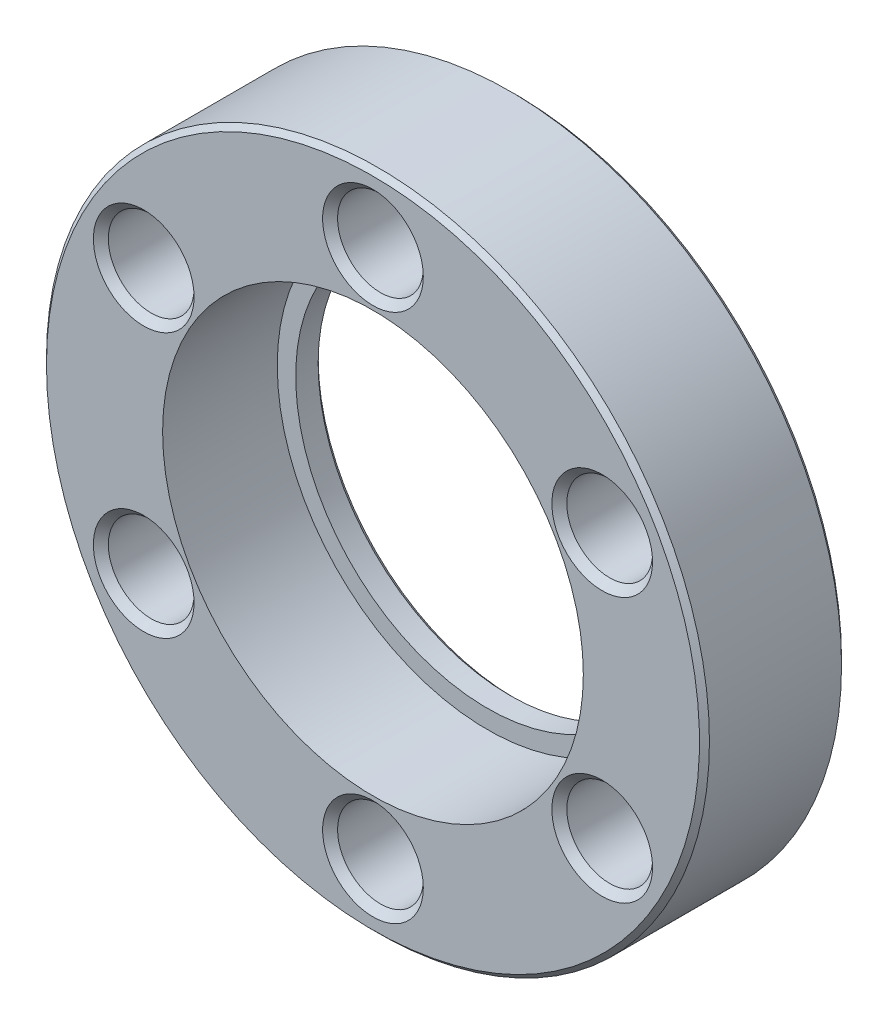
ISO-10303-21;
HEADER;
FILE_DESCRIPTION(('STEP AP214'),'2;1');
FILE_NAME('part.step','',(''),(''),'','','');
FILE_SCHEMA(('AUTOMOTIVE_DESIGN { 1 0 10303 214 1 1 1 1 }'));
ENDSEC;
DATA;
#1=APPLICATION_CONTEXT('core data for automotive mechanical design processes');
#2=APPLICATION_PROTOCOL_DEFINITION('international standard','automotive_design',2000,#1);
#3=PRODUCT_CONTEXT('',#1,'mechanical');
#4=PRODUCT('Part','Part','',(#3));
#5=PRODUCT_RELATED_PRODUCT_CATEGORY('part','',(#4));
#6=PRODUCT_DEFINITION_FORMATION('','',#4);
#7=PRODUCT_DEFINITION_CONTEXT('part definition',#1,'design');
#8=PRODUCT_DEFINITION('design','',#6,#7);
#9=PRODUCT_DEFINITION_SHAPE('','',#8);
#10=(LENGTH_UNIT() NAMED_UNIT(*) SI_UNIT(.MILLI.,.METRE.));
#11=(NAMED_UNIT(*) PLANE_ANGLE_UNIT() SI_UNIT($,.RADIAN.));
#12=(NAMED_UNIT(*) SI_UNIT($,.STERADIAN.) SOLID_ANGLE_UNIT());
#13=UNCERTAINTY_MEASURE_WITH_UNIT(LENGTH_MEASURE(1.E-05),#10,'distance_accuracy_value','');
#14=(GEOMETRIC_REPRESENTATION_CONTEXT(3) GLOBAL_UNCERTAINTY_ASSIGNED_CONTEXT((#13)) GLOBAL_UNIT_ASSIGNED_CONTEXT((#10,
#11,#12)) REPRESENTATION_CONTEXT('',''));
#15=CARTESIAN_POINT('',(0.,0.,0.));
#16=DIRECTION('',(0.,0.,1.));
#17=DIRECTION('',(1.,0.,0.));
#18=AXIS2_PLACEMENT_3D('',#15,#16,#17);
#19=CARTESIAN_POINT('',(0.,0.,-7.60095));
#20=DIRECTION('',(0.,0.,1.));
#21=DIRECTION('',(1.,0.,0.));
#22=AXIS2_PLACEMENT_3D('',#19,#20,#21);
#23=CYLINDRICAL_SURFACE('',#22,10.7188);
#24=CARTESIAN_POINT('',(0.,0.,-5.842));
#25=DIRECTION('',(0.,0.,1.));
#26=DIRECTION('',(1.,0.,0.));
#27=AXIS2_PLACEMENT_3D('',#24,#25,#26);
#28=CIRCLE('',#27,10.7188);
#29=CARTESIAN_POINT('',(10.7188,0.,-5.842));
#30=VERTEX_POINT('',#29);
#31=EDGE_CURVE('E72',#30,#30,#28,.T.);
#32=ORIENTED_EDGE('',*,*,#31,.F.);
#33=EDGE_LOOP('',(#32));
#34=FACE_BOUND('',#33,.T.);
#35=CARTESIAN_POINT('',(0.,0.,0.));
#36=DIRECTION('',(0.,0.,1.));
#37=DIRECTION('',(1.,0.,0.));
#38=AXIS2_PLACEMENT_3D('',#35,#36,#37);
#39=CIRCLE('',#38,10.7188);
#40=CARTESIAN_POINT('',(10.7188,0.,0.));
#41=VERTEX_POINT('',#40);
#42=EDGE_CURVE('E17',#41,#41,#39,.F.);
#43=ORIENTED_EDGE('',*,*,#42,.F.);
#44=EDGE_LOOP('',(#43));
#45=FACE_BOUND('',#44,.T.);
#46=ADVANCED_FACE('F14',(#34,#45),#23,.F.);
#47=CARTESIAN_POINT('',(0.,0.,0.));
#48=DIRECTION('',(0.,0.,1.));
#49=DIRECTION('',(1.,0.,0.));
#50=AXIS2_PLACEMENT_3D('',#47,#48,#49);
#51=PLANE('',#50);
#52=CARTESIAN_POINT('',(-11.6804310310013,6.7437,-5.6843418860808E-11));
#53=DIRECTION('',(0.,0.,1.));
#54=DIRECTION('',(1.,0.,0.));
#55=AXIS2_PLACEMENT_3D('',#52,#53,#54);
#56=CIRCLE('',#55,2.56539999999999);
#57=CARTESIAN_POINT('',(-9.11503103100131,6.7437,-5.6843418860808E-11));
#58=VERTEX_POINT('',#57);
#59=EDGE_CURVE('E54',#58,#58,#56,.F.);
#60=ORIENTED_EDGE('',*,*,#59,.T.);
#61=EDGE_LOOP('',(#60));
#62=FACE_BOUND('',#61,.T.);
#63=CARTESIAN_POINT('',(-11.6804310310013,-6.7437,-5.6843418860808E-11));
#64=DIRECTION('',(0.,0.,1.));
#65=DIRECTION('',(1.,0.,0.));
#66=AXIS2_PLACEMENT_3D('',#63,#64,#65);
#67=CIRCLE('',#66,2.56539999999999);
#68=CARTESIAN_POINT('',(-9.11503103100131,-6.7437,-5.6843418860808E-11));
#69=VERTEX_POINT('',#68);
#70=EDGE_CURVE('E57',#69,#69,#67,.F.);
#71=ORIENTED_EDGE('',*,*,#70,.T.);
#72=EDGE_LOOP('',(#71));
#73=FACE_BOUND('',#72,.T.);
#74=CARTESIAN_POINT('',(0.,-13.4874,0.));
#75=DIRECTION('',(0.,0.,1.));
#76=DIRECTION('',(1.,0.,0.));
#77=AXIS2_PLACEMENT_3D('',#74,#75,#76);
#78=CIRCLE('',#77,2.5653999999804);
#79=CARTESIAN_POINT('',(2.5653999999804,-13.4874,0.));
#80=VERTEX_POINT('',#79);
#81=EDGE_CURVE('E60',#80,#80,#78,.F.);
#82=ORIENTED_EDGE('',*,*,#81,.T.);
#83=EDGE_LOOP('',(#82));
#84=FACE_BOUND('',#83,.T.);
#85=CARTESIAN_POINT('',(11.6804310310013,-6.7437,0.));
#86=DIRECTION('',(0.,0.,1.));
#87=DIRECTION('',(1.,0.,0.));
#88=AXIS2_PLACEMENT_3D('',#85,#86,#87);
#89=CIRCLE('',#88,2.56540000001765);
#90=CARTESIAN_POINT('',(14.245831031019,-6.7437,0.));
#91=VERTEX_POINT('',#90);
#92=EDGE_CURVE('E63',#91,#91,#89,.F.);
#93=ORIENTED_EDGE('',*,*,#92,.T.);
#94=EDGE_LOOP('',(#93));
#95=FACE_BOUND('',#94,.T.);
#96=CARTESIAN_POINT('',(11.6804310310013,6.7437,0.));
#97=DIRECTION('',(0.,0.,1.));
#98=DIRECTION('',(1.,0.,0.));
#99=AXIS2_PLACEMENT_3D('',#96,#97,#98);
#100=CIRCLE('',#99,2.56540000001765);
#101=CARTESIAN_POINT('',(14.245831031019,6.7437,0.));
#102=VERTEX_POINT('',#101);
#103=EDGE_CURVE('E66',#102,#102,#100,.F.);
#104=ORIENTED_EDGE('',*,*,#103,.T.);
#105=EDGE_LOOP('',(#104));
#106=FACE_BOUND('',#105,.T.);
#107=CARTESIAN_POINT('',(0.,13.4874,0.));
#108=DIRECTION('',(0.,0.,1.));
#109=DIRECTION('',(1.,0.,0.));
#110=AXIS2_PLACEMENT_3D('',#107,#108,#109);
#111=CIRCLE('',#110,2.5653999999804);
#112=CARTESIAN_POINT('',(2.5653999999804,13.4874,0.));
#113=VERTEX_POINT('',#112);
#114=EDGE_CURVE('E69',#113,#113,#111,.F.);
#115=ORIENTED_EDGE('',*,*,#114,.T.);
#116=EDGE_LOOP('',(#115));
#117=FACE_BOUND('',#116,.T.);
#118=ORIENTED_EDGE('',*,*,#42,.T.);
#119=EDGE_LOOP('',(#118));
#120=FACE_BOUND('',#119,.T.);
#121=CARTESIAN_POINT('',(0.,0.,0.));
#122=DIRECTION('',(0.,0.,-1.));
#123=DIRECTION('',(-1.,0.,0.));
#124=AXIS2_PLACEMENT_3D('',#121,#122,#123);
#125=CIRCLE('',#124,16.637);
#126=CARTESIAN_POINT('',(-16.637,0.,0.));
#127=VERTEX_POINT('',#126);
#128=EDGE_CURVE('E74',#127,#127,#125,.T.);
#129=ORIENTED_EDGE('',*,*,#128,.F.);
#130=EDGE_LOOP('',(#129));
#131=FACE_BOUND('',#130,.T.);
#132=ADVANCED_FACE('F81',(#62,#73,#84,#95,#106,#117,#120,#131),#51,.T.);
#133=CARTESIAN_POINT('',(0.,0.,-0.254000000000019));
#134=DIRECTION('',(0.,0.,-1.));
#135=DIRECTION('',(-1.,0.,0.));
#136=AXIS2_PLACEMENT_3D('',#133,#134,#135);
#137=CONICAL_SURFACE('',#136,16.891,0.785398163397301);
#138=CARTESIAN_POINT('',(0.,0.,-0.254));
#139=DIRECTION('',(0.,0.,1.));
#140=DIRECTION('',(1.,0.,0.));
#141=AXIS2_PLACEMENT_3D('',#138,#139,#140);
#142=CIRCLE('',#141,16.891);
#143=CARTESIAN_POINT('',(16.891,0.,-0.254));
#144=VERTEX_POINT('',#143);
#145=EDGE_CURVE('E29',#144,#144,#142,.F.);
#146=ORIENTED_EDGE('',*,*,#145,.F.);
#147=EDGE_LOOP('',(#146));
#148=FACE_BOUND('',#147,.T.);
#149=ORIENTED_EDGE('',*,*,#128,.T.);
#150=EDGE_LOOP('',(#149));
#151=FACE_BOUND('',#150,.T.);
#152=ADVANCED_FACE('F90',(#148,#151),#137,.T.);
#153=CARTESIAN_POINT('',(0.,0.,-5.842));
#154=DIRECTION('',(0.,0.,1.));
#155=DIRECTION('',(1.,0.,0.));
#156=AXIS2_PLACEMENT_3D('',#153,#154,#155);
#157=PLANE('',#156);
#158=CARTESIAN_POINT('',(0.,0.,-5.842));
#159=DIRECTION('',(0.,0.,1.));
#160=DIRECTION('',(1.,0.,0.));
#161=AXIS2_PLACEMENT_3D('',#158,#159,#160);
#162=CIRCLE('',#161,9.779);
#163=CARTESIAN_POINT('',(9.779,0.,-5.842));
#164=VERTEX_POINT('',#163);
#165=EDGE_CURVE('E50',#164,#164,#162,.F.);
#166=ORIENTED_EDGE('',*,*,#165,.T.);
#167=EDGE_LOOP('',(#166));
#168=FACE_BOUND('',#167,.T.);
#169=ORIENTED_EDGE('',*,*,#31,.T.);
#170=EDGE_LOOP('',(#169));
#171=FACE_BOUND('',#170,.T.);
#172=ADVANCED_FACE('F188',(#168,#171),#157,.T.);
#173=CARTESIAN_POINT('',(0.,13.4874,-5.6843418860808E-11));
#174=DIRECTION('',(0.,0.,1.));
#175=DIRECTION('',(1.,0.,0.));
#176=AXIS2_PLACEMENT_3D('',#173,#174,#175);
#177=CONICAL_SURFACE('',#176,2.56539999992356,0.785398163397448);
#178=CARTESIAN_POINT('',(0.,13.4874,-0.381));
#179=DIRECTION('',(0.,0.,-1.));
#180=DIRECTION('',(-1.,0.,0.));
#181=AXIS2_PLACEMENT_3D('',#178,#179,#180);
#182=CIRCLE('',#181,2.1844);
#183=CARTESIAN_POINT('',(-2.1844,13.4874,-0.381));
#184=VERTEX_POINT('',#183);
#185=EDGE_CURVE('E53',#184,#184,#182,.T.);
#186=ORIENTED_EDGE('',*,*,#185,.T.);
#187=EDGE_LOOP('',(#186));
#188=FACE_BOUND('',#187,.T.);
#189=ORIENTED_EDGE('',*,*,#114,.F.);
#190=EDGE_LOOP('',(#189));
#191=FACE_BOUND('',#190,.T.);
#192=ADVANCED_FACE('F184',(#188,#191),#177,.F.);
#193=CARTESIAN_POINT('',(11.6804310310013,6.7437,5.6843418860808E-11));
#194=DIRECTION('',(0.,0.,1.));
#195=DIRECTION('',(1.,0.,0.));
#196=AXIS2_PLACEMENT_3D('',#193,#194,#195);
#197=CONICAL_SURFACE('',#196,2.56540000007449,0.785398163397448);
#198=CARTESIAN_POINT('',(11.6804310310013,6.7437,-0.381));
#199=DIRECTION('',(0.,0.,-1.));
#200=DIRECTION('',(-1.,0.,0.));
#201=AXIS2_PLACEMENT_3D('',#198,#199,#200);
#202=CIRCLE('',#201,2.1844);
#203=CARTESIAN_POINT('',(9.4960310310013,6.7437,-0.381));
#204=VERTEX_POINT('',#203);
#205=EDGE_CURVE('E335',#204,#204,#202,.T.);
#206=ORIENTED_EDGE('',*,*,#205,.T.);
#207=EDGE_LOOP('',(#206));
#208=FACE_BOUND('',#207,.T.);
#209=ORIENTED_EDGE('',*,*,#103,.F.);
#210=EDGE_LOOP('',(#209));
#211=FACE_BOUND('',#210,.T.);
#212=ADVANCED_FACE('F180',(#208,#211),#197,.F.);
#213=CARTESIAN_POINT('',(11.6804310310013,-6.7437,5.6843418860808E-11));
#214=DIRECTION('',(0.,0.,1.));
#215=DIRECTION('',(1.,0.,0.));
#216=AXIS2_PLACEMENT_3D('',#213,#214,#215);
#217=CONICAL_SURFACE('',#216,2.56540000007449,0.785398163397448);
#218=CARTESIAN_POINT('',(11.6804310310013,-6.7437,-0.381));
#219=DIRECTION('',(0.,0.,-1.));
#220=DIRECTION('',(-1.,0.,0.));
#221=AXIS2_PLACEMENT_3D('',#218,#219,#220);
#222=CIRCLE('',#221,2.1844);
#223=CARTESIAN_POINT('',(9.4960310310013,-6.7437,-0.381));
#224=VERTEX_POINT('',#223);
#225=EDGE_CURVE('E332',#224,#224,#222,.T.);
#226=ORIENTED_EDGE('',*,*,#225,.T.);
#227=EDGE_LOOP('',(#226));
#228=FACE_BOUND('',#227,.T.);
#229=ORIENTED_EDGE('',*,*,#92,.F.);
#230=EDGE_LOOP('',(#229));
#231=FACE_BOUND('',#230,.T.);
#232=ADVANCED_FACE('F176',(#228,#231),#217,.F.);
#233=CARTESIAN_POINT('',(0.,-13.4874,-5.6843418860808E-11));
#234=DIRECTION('',(0.,0.,1.));
#235=DIRECTION('',(1.,0.,0.));
#236=AXIS2_PLACEMENT_3D('',#233,#234,#235);
#237=CONICAL_SURFACE('',#236,2.56539999992356,0.785398163397448);
#238=CARTESIAN_POINT('',(0.,-13.4874,-0.381));
#239=DIRECTION('',(0.,0.,-1.));
#240=DIRECTION('',(-1.,0.,0.));
#241=AXIS2_PLACEMENT_3D('',#238,#239,#240);
#242=CIRCLE('',#241,2.1844);
#243=CARTESIAN_POINT('',(-2.1844,-13.4874,-0.381));
#244=VERTEX_POINT('',#243);
#245=EDGE_CURVE('E329',#244,#244,#242,.T.);
#246=ORIENTED_EDGE('',*,*,#245,.T.);
#247=EDGE_LOOP('',(#246));
#248=FACE_BOUND('',#247,.T.);
#249=ORIENTED_EDGE('',*,*,#81,.F.);
#250=EDGE_LOOP('',(#249));
#251=FACE_BOUND('',#250,.T.);
#252=ADVANCED_FACE('F172',(#248,#251),#237,.F.);
#253=CARTESIAN_POINT('',(-11.6804310310013,-6.7437,-5.6843418860808E-11));
#254=DIRECTION('',(0.,0.,1.));
#255=DIRECTION('',(1.,0.,0.));
#256=AXIS2_PLACEMENT_3D('',#253,#254,#255);
#257=CONICAL_SURFACE('',#256,2.56539999999999,0.785398163397448);
#258=CARTESIAN_POINT('',(-11.6804310310013,-6.7437,-0.381));
#259=DIRECTION('',(0.,0.,-1.));
#260=DIRECTION('',(-1.,0.,0.));
#261=AXIS2_PLACEMENT_3D('',#258,#259,#260);
#262=CIRCLE('',#261,2.1844);
#263=CARTESIAN_POINT('',(-13.8648310310013,-6.7437,-0.381));
#264=VERTEX_POINT('',#263);
#265=EDGE_CURVE('E326',#264,#264,#262,.T.);
#266=ORIENTED_EDGE('',*,*,#265,.T.);
#267=EDGE_LOOP('',(#266));
#268=FACE_BOUND('',#267,.T.);
#269=ORIENTED_EDGE('',*,*,#70,.F.);
#270=EDGE_LOOP('',(#269));
#271=FACE_BOUND('',#270,.T.);
#272=ADVANCED_FACE('F168',(#268,#271),#257,.F.);
#273=CARTESIAN_POINT('',(-11.6804310310013,6.7437,-5.6843418860808E-11));
#274=DIRECTION('',(0.,0.,1.));
#275=DIRECTION('',(1.,0.,0.));
#276=AXIS2_PLACEMENT_3D('',#273,#274,#275);
#277=CONICAL_SURFACE('',#276,2.56539999999999,0.785398163397448);
#278=CARTESIAN_POINT('',(-11.6804310310013,6.7437,-0.381));
#279=DIRECTION('',(0.,0.,-1.));
#280=DIRECTION('',(-1.,0.,0.));
#281=AXIS2_PLACEMENT_3D('',#278,#279,#280);
#282=CIRCLE('',#281,2.1844);
#283=CARTESIAN_POINT('',(-13.8648310310013,6.7437,-0.381));
#284=VERTEX_POINT('',#283);
#285=EDGE_CURVE('E320',#284,#284,#282,.T.);
#286=ORIENTED_EDGE('',*,*,#285,.T.);
#287=EDGE_LOOP('',(#286));
#288=FACE_BOUND('',#287,.T.);
#289=ORIENTED_EDGE('',*,*,#59,.F.);
#290=EDGE_LOOP('',(#289));
#291=FACE_BOUND('',#290,.T.);
#292=ADVANCED_FACE('F164',(#288,#291),#277,.F.);
#293=CARTESIAN_POINT('',(0.,0.,0.));
#294=DIRECTION('',(0.,0.,1.));
#295=DIRECTION('',(1.,0.,0.));
#296=AXIS2_PLACEMENT_3D('',#293,#294,#295);
#297=CYLINDRICAL_SURFACE('',#296,16.891);
#298=CARTESIAN_POINT('',(0.,0.,-6.98499999999998));
#299=DIRECTION('',(0.,0.,1.));
#300=DIRECTION('',(1.,0.,0.));
#301=AXIS2_PLACEMENT_3D('',#298,#299,#300);
#302=CIRCLE('',#301,16.891);
#303=CARTESIAN_POINT('',(16.891,0.,-6.98499999999998));
#304=VERTEX_POINT('',#303);
#305=EDGE_CURVE('E314',#304,#304,#302,.F.);
#306=ORIENTED_EDGE('',*,*,#305,.F.);
#307=EDGE_LOOP('',(#306));
#308=FACE_BOUND('',#307,.T.);
#309=ORIENTED_EDGE('',*,*,#145,.T.);
#310=EDGE_LOOP('',(#309));
#311=FACE_BOUND('',#310,.T.);
#312=ADVANCED_FACE('F160',(#308,#311),#297,.T.);
#313=CARTESIAN_POINT('',(0.,0.,-7.60095));
#314=DIRECTION('',(0.,0.,1.));
#315=DIRECTION('',(1.,0.,0.));
#316=AXIS2_PLACEMENT_3D('',#313,#314,#315);
#317=CYLINDRICAL_SURFACE('',#316,9.779);
#318=ORIENTED_EDGE('',*,*,#165,.F.);
#319=EDGE_LOOP('',(#318));
#320=FACE_BOUND('',#319,.T.);
#321=CARTESIAN_POINT('',(0.,0.,-6.98499999999998));
#322=DIRECTION('',(0.,0.,-1.));
#323=DIRECTION('',(0.,-1.,0.));
#324=AXIS2_PLACEMENT_3D('',#321,#322,#323);
#325=CIRCLE('',#324,9.77900000000002);
#326=CARTESIAN_POINT('',(0.,-9.77900000000002,-6.98499999999998));
#327=VERTEX_POINT('',#326);
#328=EDGE_CURVE('E312',#327,#327,#325,.T.);
#329=ORIENTED_EDGE('',*,*,#328,.T.);
#330=EDGE_LOOP('',(#329));
#331=FACE_BOUND('',#330,.T.);
#332=ADVANCED_FACE('F156',(#320,#331),#317,.F.);
#333=CARTESIAN_POINT('',(0.,13.4874,0.));
#334=DIRECTION('',(0.,0.,-1.));
#335=DIRECTION('',(-1.,0.,0.));
#336=AXIS2_PLACEMENT_3D('',#333,#334,#335);
#337=CYLINDRICAL_SURFACE('',#336,2.1844);
#338=CARTESIAN_POINT('',(0.,13.4874,-6.85799999996561));
#339=DIRECTION('',(0.,0.,-1.));
#340=DIRECTION('',(-1.,0.,0.));
#341=AXIS2_PLACEMENT_3D('',#338,#339,#340);
#342=CIRCLE('',#341,2.18439999997599);
#343=CARTESIAN_POINT('',(-2.18439999997599,13.4874,-6.85799999996561));
#344=VERTEX_POINT('',#343);
#345=EDGE_CURVE('E313',#344,#344,#342,.T.);
#346=ORIENTED_EDGE('',*,*,#345,.T.);
#347=EDGE_LOOP('',(#346));
#348=FACE_BOUND('',#347,.T.);
#349=ORIENTED_EDGE('',*,*,#185,.F.);
#350=EDGE_LOOP('',(#349));
#351=FACE_BOUND('',#350,.T.);
#352=ADVANCED_FACE('F152',(#348,#351),#337,.F.);
#353=CARTESIAN_POINT('',(11.6804310310013,6.7437,0.));
#354=DIRECTION('',(0.,0.,-1.));
#355=DIRECTION('',(-1.,0.,0.));
#356=AXIS2_PLACEMENT_3D('',#353,#354,#355);
#357=CYLINDRICAL_SURFACE('',#356,2.1844);
#358=CARTESIAN_POINT('',(11.6804310310013,6.7437,-6.85800000002246));
#359=DIRECTION('',(0.,0.,-1.));
#360=DIRECTION('',(-1.,0.,0.));
#361=AXIS2_PLACEMENT_3D('',#358,#359,#360);
#362=CIRCLE('',#361,2.18439999999559);
#363=CARTESIAN_POINT('',(9.49603103100571,6.7437,-6.85800000002246));
#364=VERTEX_POINT('',#363);
#365=EDGE_CURVE('E317',#364,#364,#362,.T.);
#366=ORIENTED_EDGE('',*,*,#365,.T.);
#367=EDGE_LOOP('',(#366));
#368=FACE_BOUND('',#367,.T.);
#369=ORIENTED_EDGE('',*,*,#205,.F.);
#370=EDGE_LOOP('',(#369));
#371=FACE_BOUND('',#370,.T.);
#372=ADVANCED_FACE('F148',(#368,#371),#357,.F.);
#373=CARTESIAN_POINT('',(11.6804310310013,-6.7437,0.));
#374=DIRECTION('',(0.,0.,-1.));
#375=DIRECTION('',(-1.,0.,0.));
#376=AXIS2_PLACEMENT_3D('',#373,#374,#375);
#377=CYLINDRICAL_SURFACE('',#376,2.1844);
#378=CARTESIAN_POINT('',(11.6804310310013,-6.7437,-6.85800000002246));
#379=DIRECTION('',(0.,0.,-1.));
#380=DIRECTION('',(-1.,0.,0.));
#381=AXIS2_PLACEMENT_3D('',#378,#379,#380);
#382=CIRCLE('',#381,2.18439999999559);
#383=CARTESIAN_POINT('',(9.49603103100571,-6.7437,-6.85800000002246));
#384=VERTEX_POINT('',#383);
#385=EDGE_CURVE('E369',#384,#384,#382,.T.);
#386=ORIENTED_EDGE('',*,*,#385,.T.);
#387=EDGE_LOOP('',(#386));
#388=FACE_BOUND('',#387,.T.);
#389=ORIENTED_EDGE('',*,*,#225,.F.);
#390=EDGE_LOOP('',(#389));
#391=FACE_BOUND('',#390,.T.);
#392=ADVANCED_FACE('F144',(#388,#391),#377,.F.);
#393=CARTESIAN_POINT('',(0.,-13.4874,0.));
#394=DIRECTION('',(0.,0.,-1.));
#395=DIRECTION('',(-1.,0.,0.));
#396=AXIS2_PLACEMENT_3D('',#393,#394,#395);
#397=CYLINDRICAL_SURFACE('',#396,2.1844);
#398=CARTESIAN_POINT('',(0.,-13.4874,-6.85799999996561));
#399=DIRECTION('',(0.,0.,-1.));
#400=DIRECTION('',(-1.,0.,0.));
#401=AXIS2_PLACEMENT_3D('',#398,#399,#400);
#402=CIRCLE('',#401,2.18439999997599);
#403=CARTESIAN_POINT('',(-2.18439999997599,-13.4874,-6.85799999996561));
#404=VERTEX_POINT('',#403);
#405=EDGE_CURVE('E372',#404,#404,#402,.T.);
#406=ORIENTED_EDGE('',*,*,#405,.T.);
#407=EDGE_LOOP('',(#406));
#408=FACE_BOUND('',#407,.T.);
#409=ORIENTED_EDGE('',*,*,#245,.F.);
#410=EDGE_LOOP('',(#409));
#411=FACE_BOUND('',#410,.T.);
#412=ADVANCED_FACE('F140',(#408,#411),#397,.F.);
#413=CARTESIAN_POINT('',(-11.6804310310013,-6.7437,0.));
#414=DIRECTION('',(0.,0.,-1.));
#415=DIRECTION('',(-1.,0.,0.));
#416=AXIS2_PLACEMENT_3D('',#413,#414,#415);
#417=CYLINDRICAL_SURFACE('',#416,2.1844);
#418=CARTESIAN_POINT('',(-11.6804310310013,-6.7437,-6.85800000002246));
#419=DIRECTION('',(0.,0.,-1.));
#420=DIRECTION('',(-1.,0.,0.));
#421=AXIS2_PLACEMENT_3D('',#418,#419,#420);
#422=CIRCLE('',#421,2.18440000001325);
#423=CARTESIAN_POINT('',(-13.8648310310145,-6.7437,-6.85800000002246));
#424=VERTEX_POINT('',#423);
#425=EDGE_CURVE('E375',#424,#424,#422,.T.);
#426=ORIENTED_EDGE('',*,*,#425,.T.);
#427=EDGE_LOOP('',(#426));
#428=FACE_BOUND('',#427,.T.);
#429=ORIENTED_EDGE('',*,*,#265,.F.);
#430=EDGE_LOOP('',(#429));
#431=FACE_BOUND('',#430,.T.);
#432=ADVANCED_FACE('F136',(#428,#431),#417,.F.);
#433=CARTESIAN_POINT('',(-11.6804310310013,6.7437,0.));
#434=DIRECTION('',(0.,0.,-1.));
#435=DIRECTION('',(-1.,0.,0.));
#436=AXIS2_PLACEMENT_3D('',#433,#434,#435);
#437=CYLINDRICAL_SURFACE('',#436,2.1844);
#438=CARTESIAN_POINT('',(-11.6804310310013,6.7437,-6.85800000002246));
#439=DIRECTION('',(0.,0.,-1.));
#440=DIRECTION('',(-1.,0.,0.));
#441=AXIS2_PLACEMENT_3D('',#438,#439,#440);
#442=CIRCLE('',#441,2.18440000001325);
#443=CARTESIAN_POINT('',(-13.8648310310145,6.7437,-6.85800000002246));
#444=VERTEX_POINT('',#443);
#445=EDGE_CURVE('E49',#444,#444,#442,.T.);
#446=ORIENTED_EDGE('',*,*,#445,.T.);
#447=EDGE_LOOP('',(#446));
#448=FACE_BOUND('',#447,.T.);
#449=ORIENTED_EDGE('',*,*,#285,.F.);
#450=EDGE_LOOP('',(#449));
#451=FACE_BOUND('',#450,.T.);
#452=ADVANCED_FACE('F132',(#448,#451),#437,.F.);
#453=CARTESIAN_POINT('',(0.,0.,-6.98499999999998));
#454=DIRECTION('',(0.,0.,1.));
#455=DIRECTION('',(1.,0.,0.));
#456=AXIS2_PLACEMENT_3D('',#453,#454,#455);
#457=CONICAL_SURFACE('',#456,16.891,0.7853981633973);
#458=ORIENTED_EDGE('',*,*,#305,.T.);
#459=EDGE_LOOP('',(#458));
#460=FACE_BOUND('',#459,.T.);
#461=CARTESIAN_POINT('',(0.,0.,-7.23900000000002));
#462=DIRECTION('',(0.,0.,1.));
#463=DIRECTION('',(1.,0.,0.));
#464=AXIS2_PLACEMENT_3D('',#461,#462,#463);
#465=CIRCLE('',#464,16.637);
#466=CARTESIAN_POINT('',(16.637,0.,-7.23900000000002));
#467=VERTEX_POINT('',#466);
#468=EDGE_CURVE('E46',#467,#467,#465,.T.);
#469=ORIENTED_EDGE('',*,*,#468,.T.);
#470=EDGE_LOOP('',(#469));
#471=FACE_BOUND('',#470,.T.);
#472=ADVANCED_FACE('F128',(#460,#471),#457,.T.);
#473=CARTESIAN_POINT('',(0.,0.,-7.23900000000002));
#474=DIRECTION('',(0.,0.,-1.));
#475=DIRECTION('',(-1.,0.,0.));
#476=AXIS2_PLACEMENT_3D('',#473,#474,#475);
#477=CONICAL_SURFACE('',#476,10.033,0.785398163397298);
#478=ORIENTED_EDGE('',*,*,#328,.F.);
#479=EDGE_LOOP('',(#478));
#480=FACE_BOUND('',#479,.T.);
#481=CARTESIAN_POINT('',(0.,0.,-7.23900000000002));
#482=DIRECTION('',(0.,0.,-1.));
#483=DIRECTION('',(-1.,0.,0.));
#484=AXIS2_PLACEMENT_3D('',#481,#482,#483);
#485=CIRCLE('',#484,10.033);
#486=CARTESIAN_POINT('',(-10.033,0.,-7.23900000000002));
#487=VERTEX_POINT('',#486);
#488=EDGE_CURVE('E43',#487,#487,#485,.T.);
#489=ORIENTED_EDGE('',*,*,#488,.T.);
#490=EDGE_LOOP('',(#489));
#491=FACE_BOUND('',#490,.T.);
#492=ADVANCED_FACE('F124',(#480,#491),#477,.F.);
#493=CARTESIAN_POINT('',(0.,13.4874,-7.23900000002686));
#494=DIRECTION('',(0.,0.,-1.));
#495=DIRECTION('',(0.,1.,0.));
#496=AXIS2_PLACEMENT_3D('',#493,#494,#495);
#497=CONICAL_SURFACE('',#496,2.56540000003724,0.785398163397448);
#498=ORIENTED_EDGE('',*,*,#345,.F.);
#499=EDGE_LOOP('',(#498));
#500=FACE_BOUND('',#499,.T.);
#501=CARTESIAN_POINT('',(0.,13.4874,-7.23900000002686));
#502=DIRECTION('',(0.,0.,-1.));
#503=DIRECTION('',(0.,1.,0.));
#504=AXIS2_PLACEMENT_3D('',#501,#502,#503);
#505=CIRCLE('',#504,2.56540000003724);
#506=CARTESIAN_POINT('',(0.,16.0528000000372,-7.23900000002686));
#507=VERTEX_POINT('',#506);
#508=EDGE_CURVE('E40',#507,#507,#505,.T.);
#509=ORIENTED_EDGE('',*,*,#508,.T.);
#510=EDGE_LOOP('',(#509));
#511=FACE_BOUND('',#510,.T.);
#512=ADVANCED_FACE('F120',(#500,#511),#497,.F.);
#513=CARTESIAN_POINT('',(11.6804310310013,6.7437,-7.23899999997002));
#514=DIRECTION('',(0.,0.,-1.));
#515=DIRECTION('',(-1.,0.,0.));
#516=AXIS2_PLACEMENT_3D('',#513,#514,#515);
#517=CONICAL_SURFACE('',#516,2.56539999994315,0.785398163397448);
#518=ORIENTED_EDGE('',*,*,#365,.F.);
#519=EDGE_LOOP('',(#518));
#520=FACE_BOUND('',#519,.T.);
#521=CARTESIAN_POINT('',(11.6804310310013,6.7437,-7.23899999997002));
#522=DIRECTION('',(0.,0.,-1.));
#523=DIRECTION('',(-1.,0.,0.));
#524=AXIS2_PLACEMENT_3D('',#521,#522,#523);
#525=CIRCLE('',#524,2.56539999994315);
#526=CARTESIAN_POINT('',(9.11503103105815,6.7437,-7.23899999997002));
#527=VERTEX_POINT('',#526);
#528=EDGE_CURVE('E37',#527,#527,#525,.T.);
#529=ORIENTED_EDGE('',*,*,#528,.T.);
#530=EDGE_LOOP('',(#529));
#531=FACE_BOUND('',#530,.T.);
#532=ADVANCED_FACE('F116',(#520,#531),#517,.F.);
#533=CARTESIAN_POINT('',(11.6804310310013,-6.7437,-7.23899999997002));
#534=DIRECTION('',(0.,0.,-1.));
#535=DIRECTION('',(-1.,0.,0.));
#536=AXIS2_PLACEMENT_3D('',#533,#534,#535);
#537=CONICAL_SURFACE('',#536,2.56539999994315,0.785398163397448);
#538=ORIENTED_EDGE('',*,*,#385,.F.);
#539=EDGE_LOOP('',(#538));
#540=FACE_BOUND('',#539,.T.);
#541=CARTESIAN_POINT('',(11.6804310310013,-6.7437,-7.23899999997002));
#542=DIRECTION('',(0.,0.,-1.));
#543=DIRECTION('',(-1.,0.,0.));
#544=AXIS2_PLACEMENT_3D('',#541,#542,#543);
#545=CIRCLE('',#544,2.56539999994315);
#546=CARTESIAN_POINT('',(9.11503103105815,-6.7437,-7.23899999997002));
#547=VERTEX_POINT('',#546);
#548=EDGE_CURVE('E34',#547,#547,#545,.T.);
#549=ORIENTED_EDGE('',*,*,#548,.T.);
#550=EDGE_LOOP('',(#549));
#551=FACE_BOUND('',#550,.T.);
#552=ADVANCED_FACE('F112',(#540,#551),#537,.F.);
#553=CARTESIAN_POINT('',(0.,-13.4874,-7.23900000002686));
#554=DIRECTION('',(0.,0.,-1.));
#555=DIRECTION('',(0.,1.,0.));
#556=AXIS2_PLACEMENT_3D('',#553,#554,#555);
#557=CONICAL_SURFACE('',#556,2.56540000003724,0.785398163397448);
#558=ORIENTED_EDGE('',*,*,#405,.F.);
#559=EDGE_LOOP('',(#558));
#560=FACE_BOUND('',#559,.T.);
#561=CARTESIAN_POINT('',(0.,-13.4874,-7.23900000002686));
#562=DIRECTION('',(0.,0.,-1.));
#563=DIRECTION('',(0.,1.,0.));
#564=AXIS2_PLACEMENT_3D('',#561,#562,#563);
#565=CIRCLE('',#564,2.56540000003724);
#566=CARTESIAN_POINT('',(0.,-10.9219999999628,-7.23900000002686));
#567=VERTEX_POINT('',#566);
#568=EDGE_CURVE('E26',#567,#567,#565,.T.);
#569=ORIENTED_EDGE('',*,*,#568,.T.);
#570=EDGE_LOOP('',(#569));
#571=FACE_BOUND('',#570,.T.);
#572=ADVANCED_FACE('F108',(#560,#571),#557,.F.);
#573=CARTESIAN_POINT('',(-11.6804310310013,-6.7437,-7.23899999997002));
#574=DIRECTION('',(0.,0.,-1.));
#575=DIRECTION('',(-1.,0.,0.));
#576=AXIS2_PLACEMENT_3D('',#573,#574,#575);
#577=CONICAL_SURFACE('',#576,2.56540000001765,0.785398163472046);
#578=ORIENTED_EDGE('',*,*,#425,.F.);
#579=EDGE_LOOP('',(#578));
#580=FACE_BOUND('',#579,.T.);
#581=CARTESIAN_POINT('',(-11.6804310310013,-6.7437,-7.23899999993277));
#582=DIRECTION('',(0.,0.,-1.));
#583=DIRECTION('',(-1.,0.,0.));
#584=AXIS2_PLACEMENT_3D('',#581,#582,#583);
#585=CIRCLE('',#584,2.5653999999804);
#586=CARTESIAN_POINT('',(-14.2458310309817,-6.7437,-7.23899999993277));
#587=VERTEX_POINT('',#586);
#588=EDGE_CURVE('E21',#587,#587,#585,.T.);
#589=ORIENTED_EDGE('',*,*,#588,.T.);
#590=EDGE_LOOP('',(#589));
#591=FACE_BOUND('',#590,.T.);
#592=ADVANCED_FACE('F101',(#580,#591),#577,.F.);
#593=CARTESIAN_POINT('',(-11.6804310310013,6.7437,-7.23899999997002));
#594=DIRECTION('',(0.,0.,-1.));
#595=DIRECTION('',(-1.,0.,0.));
#596=AXIS2_PLACEMENT_3D('',#593,#594,#595);
#597=CONICAL_SURFACE('',#596,2.56540000001765,0.785398163472046);
#598=ORIENTED_EDGE('',*,*,#445,.F.);
#599=EDGE_LOOP('',(#598));
#600=FACE_BOUND('',#599,.T.);
#601=CARTESIAN_POINT('',(-11.6804310310013,6.7437,-7.23899999993277));
#602=DIRECTION('',(0.,0.,-1.));
#603=DIRECTION('',(-1.,0.,0.));
#604=AXIS2_PLACEMENT_3D('',#601,#602,#603);
#605=CIRCLE('',#604,2.5653999999804);
#606=CARTESIAN_POINT('',(-14.2458310309817,6.7437,-7.23899999993277));
#607=VERTEX_POINT('',#606);
#608=EDGE_CURVE('E10',#607,#607,#605,.T.);
#609=ORIENTED_EDGE('',*,*,#608,.T.);
#610=EDGE_LOOP('',(#609));
#611=FACE_BOUND('',#610,.T.);
#612=ADVANCED_FACE('F95',(#600,#611),#597,.F.);
#613=CARTESIAN_POINT('',(0.,0.,-7.239));
#614=DIRECTION('',(0.,0.,1.));
#615=DIRECTION('',(1.,0.,0.));
#616=AXIS2_PLACEMENT_3D('',#613,#614,#615);
#617=PLANE('',#616);
#618=ORIENTED_EDGE('',*,*,#608,.F.);
#619=EDGE_LOOP('',(#618));
#620=FACE_BOUND('',#619,.T.);
#621=ORIENTED_EDGE('',*,*,#588,.F.);
#622=EDGE_LOOP('',(#621));
#623=FACE_BOUND('',#622,.T.);
#624=ORIENTED_EDGE('',*,*,#568,.F.);
#625=EDGE_LOOP('',(#624));
#626=FACE_BOUND('',#625,.T.);
#627=ORIENTED_EDGE('',*,*,#548,.F.);
#628=EDGE_LOOP('',(#627));
#629=FACE_BOUND('',#628,.T.);
#630=ORIENTED_EDGE('',*,*,#528,.F.);
#631=EDGE_LOOP('',(#630));
#632=FACE_BOUND('',#631,.T.);
#633=ORIENTED_EDGE('',*,*,#508,.F.);
#634=EDGE_LOOP('',(#633));
#635=FACE_BOUND('',#634,.T.);
#636=ORIENTED_EDGE('',*,*,#488,.F.);
#637=EDGE_LOOP('',(#636));
#638=FACE_BOUND('',#637,.T.);
#639=ORIENTED_EDGE('',*,*,#468,.F.);
#640=EDGE_LOOP('',(#639));
#641=FACE_BOUND('',#640,.T.);
#642=ADVANCED_FACE('F93',(#620,#623,#626,#629,#632,#635,#638,#641),#617,.F.);
#643=CLOSED_SHELL('',(#46,#132,#152,#172,#192,#212,#232,#252,#272,#292,#312,#332,#352,#372,#392,
#412,#432,#452,#472,#492,#512,#532,#552,#572,#592,#612,#642));
#644=MANIFOLD_SOLID_BREP('B1',#643);
#645=ADVANCED_BREP_SHAPE_REPRESENTATION('',(#18,#644),#14);
#646=SHAPE_DEFINITION_REPRESENTATION(#9,#645);
ENDSEC;
END-ISO-10303-21;
